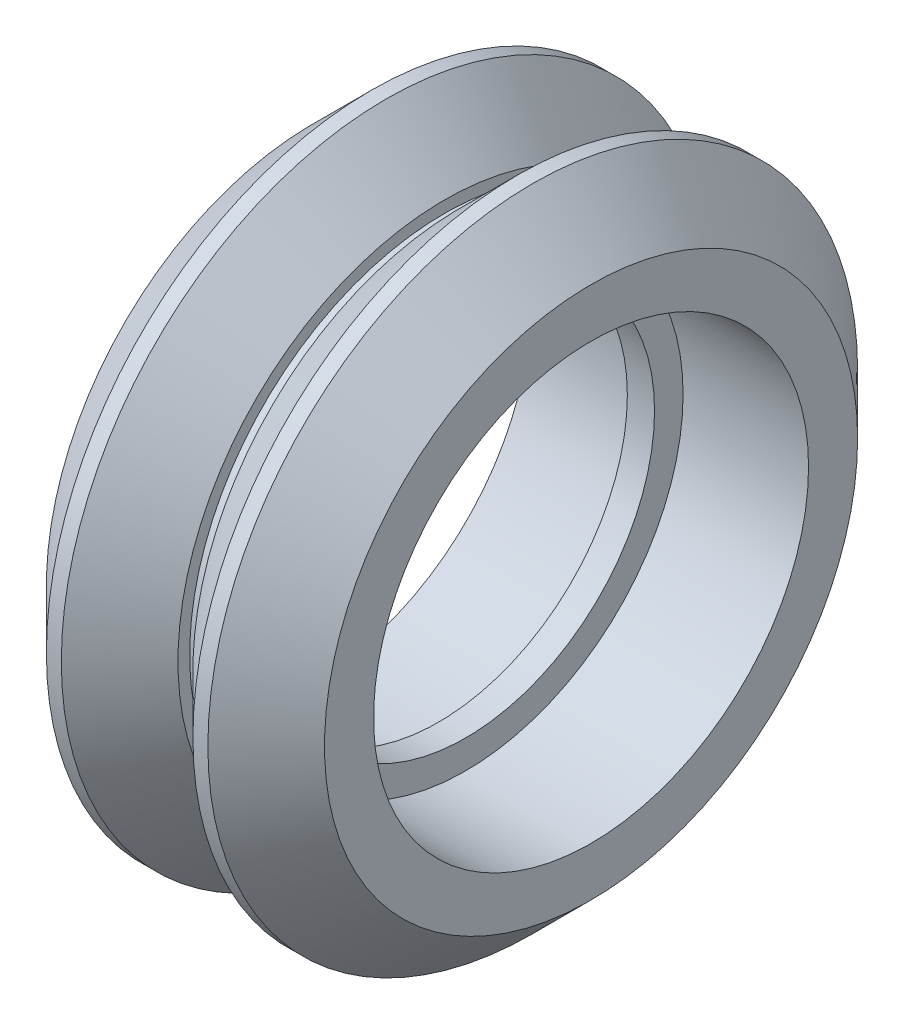
ISO-10303-21;
HEADER;
FILE_DESCRIPTION(('STEP AP214'),'2;1');
FILE_NAME('part.step','',(''),(''),'','','');
FILE_SCHEMA(('AUTOMOTIVE_DESIGN { 1 0 10303 214 1 1 1 1 }'));
ENDSEC;
DATA;
#1=APPLICATION_CONTEXT('core data for automotive mechanical design processes');
#2=APPLICATION_PROTOCOL_DEFINITION('international standard','automotive_design',2000,#1);
#3=PRODUCT_CONTEXT('',#1,'mechanical');
#4=PRODUCT('Part','Part','',(#3));
#5=PRODUCT_RELATED_PRODUCT_CATEGORY('part','',(#4));
#6=PRODUCT_DEFINITION_FORMATION('','',#4);
#7=PRODUCT_DEFINITION_CONTEXT('part definition',#1,'design');
#8=PRODUCT_DEFINITION('design','',#6,#7);
#9=PRODUCT_DEFINITION_SHAPE('','',#8);
#10=(LENGTH_UNIT() NAMED_UNIT(*) SI_UNIT(.MILLI.,.METRE.));
#11=(NAMED_UNIT(*) PLANE_ANGLE_UNIT() SI_UNIT($,.RADIAN.));
#12=(NAMED_UNIT(*) SI_UNIT($,.STERADIAN.) SOLID_ANGLE_UNIT());
#13=UNCERTAINTY_MEASURE_WITH_UNIT(LENGTH_MEASURE(1.E-05),#10,'distance_accuracy_value','');
#14=(GEOMETRIC_REPRESENTATION_CONTEXT(3) GLOBAL_UNCERTAINTY_ASSIGNED_CONTEXT((#13)) GLOBAL_UNIT_ASSIGNED_CONTEXT((#10,
#11,#12)) REPRESENTATION_CONTEXT('',''));
#15=CARTESIAN_POINT('',(0.,0.,0.));
#16=DIRECTION('',(0.,0.,1.));
#17=DIRECTION('',(1.,0.,0.));
#18=AXIS2_PLACEMENT_3D('',#15,#16,#17);
#19=CARTESIAN_POINT('',(-0.499999999999999,6.95,0.));
#20=DIRECTION('',(-1.,0.,0.));
#21=DIRECTION('',(0.,0.,1.));
#22=AXIS2_PLACEMENT_3D('',#19,#20,#21);
#23=PLANE('',#22);
#24=CARTESIAN_POINT('',(-0.499999999999999,0.,0.));
#25=DIRECTION('',(1.,0.,0.));
#26=DIRECTION('',(0.,0.,-1.));
#27=AXIS2_PLACEMENT_3D('',#24,#25,#26);
#28=CIRCLE('',#27,6.95);
#29=CARTESIAN_POINT('',(-0.499999999999999,0.,-6.95));
#30=VERTEX_POINT('',#29);
#31=EDGE_CURVE('E10',#30,#30,#28,.T.);
#32=ORIENTED_EDGE('',*,*,#31,.T.);
#33=EDGE_LOOP('',(#32));
#34=FACE_BOUND('',#33,.T.);
#35=CARTESIAN_POINT('',(-0.499999999999999,0.,0.));
#36=DIRECTION('',(1.,0.,0.));
#37=DIRECTION('',(0.,0.,-1.));
#38=AXIS2_PLACEMENT_3D('',#35,#36,#37);
#39=CIRCLE('',#38,8.);
#40=CARTESIAN_POINT('',(-0.499999999999999,0.,-8.));
#41=VERTEX_POINT('',#40);
#42=EDGE_CURVE('E84',#41,#41,#39,.T.);
#43=ORIENTED_EDGE('',*,*,#42,.F.);
#44=EDGE_LOOP('',(#43));
#45=FACE_BOUND('',#44,.T.);
#46=ADVANCED_FACE('F32',(#34,#45),#23,.T.);
#47=CARTESIAN_POINT('',(0.,0.,0.));
#48=DIRECTION('',(1.,0.,0.));
#49=DIRECTION('',(0.,0.,-1.));
#50=AXIS2_PLACEMENT_3D('',#47,#48,#49);
#51=CYLINDRICAL_SURFACE('',#50,6.95);
#52=CARTESIAN_POINT('',(0.500000000000001,0.,0.));
#53=DIRECTION('',(1.,0.,0.));
#54=DIRECTION('',(0.,0.,-1.));
#55=AXIS2_PLACEMENT_3D('',#52,#53,#54);
#56=CIRCLE('',#55,6.95);
#57=CARTESIAN_POINT('',(0.500000000000001,0.,-6.95));
#58=VERTEX_POINT('',#57);
#59=EDGE_CURVE('E38',#58,#58,#56,.T.);
#60=ORIENTED_EDGE('',*,*,#59,.T.);
#61=EDGE_LOOP('',(#60));
#62=FACE_BOUND('',#61,.T.);
#63=ORIENTED_EDGE('',*,*,#31,.F.);
#64=EDGE_LOOP('',(#63));
#65=FACE_BOUND('',#64,.T.);
#66=ADVANCED_FACE('F92',(#62,#65),#51,.F.);
#67=CARTESIAN_POINT('',(0.500000000000001,6.95,0.));
#68=DIRECTION('',(1.,0.,0.));
#69=DIRECTION('',(0.,0.,-1.));
#70=AXIS2_PLACEMENT_3D('',#67,#68,#69);
#71=PLANE('',#70);
#72=CARTESIAN_POINT('',(0.5,0.,0.));
#73=DIRECTION('',(1.,0.,0.));
#74=DIRECTION('',(0.,0.,-1.));
#75=AXIS2_PLACEMENT_3D('',#72,#73,#74);
#76=CIRCLE('',#75,8.);
#77=CARTESIAN_POINT('',(0.5,0.,-8.));
#78=VERTEX_POINT('',#77);
#79=EDGE_CURVE('E42',#78,#78,#76,.T.);
#80=ORIENTED_EDGE('',*,*,#79,.T.);
#81=EDGE_LOOP('',(#80));
#82=FACE_BOUND('',#81,.T.);
#83=ORIENTED_EDGE('',*,*,#59,.F.);
#84=EDGE_LOOP('',(#83));
#85=FACE_BOUND('',#84,.T.);
#86=ADVANCED_FACE('F96',(#82,#85),#71,.T.);
#87=CARTESIAN_POINT('',(0.,0.,0.));
#88=DIRECTION('',(1.,0.,0.));
#89=DIRECTION('',(0.,0.,-1.));
#90=AXIS2_PLACEMENT_3D('',#87,#88,#89);
#91=CYLINDRICAL_SURFACE('',#90,8.);
#92=CARTESIAN_POINT('',(5.115,0.,0.));
#93=DIRECTION('',(1.,0.,0.));
#94=DIRECTION('',(0.,0.,-1.));
#95=AXIS2_PLACEMENT_3D('',#92,#93,#94);
#96=CIRCLE('',#95,8.);
#97=CARTESIAN_POINT('',(5.115,0.,-8.));
#98=VERTEX_POINT('',#97);
#99=EDGE_CURVE('E46',#98,#98,#96,.T.);
#100=ORIENTED_EDGE('',*,*,#99,.T.);
#101=EDGE_LOOP('',(#100));
#102=FACE_BOUND('',#101,.T.);
#103=ORIENTED_EDGE('',*,*,#79,.F.);
#104=EDGE_LOOP('',(#103));
#105=FACE_BOUND('',#104,.T.);
#106=ADVANCED_FACE('F100',(#102,#105),#91,.F.);
#107=CARTESIAN_POINT('',(5.115,8.,0.));
#108=DIRECTION('',(1.,0.,0.));
#109=DIRECTION('',(0.,0.,-1.));
#110=AXIS2_PLACEMENT_3D('',#107,#108,#109);
#111=PLANE('',#110);
#112=CARTESIAN_POINT('',(5.115,0.,0.));
#113=DIRECTION('',(1.,0.,0.));
#114=DIRECTION('',(0.,0.,-1.));
#115=AXIS2_PLACEMENT_3D('',#112,#113,#114);
#116=CIRCLE('',#115,9.805);
#117=CARTESIAN_POINT('',(5.115,0.,-9.805));
#118=VERTEX_POINT('',#117);
#119=EDGE_CURVE('E51',#118,#118,#116,.T.);
#120=ORIENTED_EDGE('',*,*,#119,.T.);
#121=EDGE_LOOP('',(#120));
#122=FACE_BOUND('',#121,.T.);
#123=ORIENTED_EDGE('',*,*,#99,.F.);
#124=EDGE_LOOP('',(#123));
#125=FACE_BOUND('',#124,.T.);
#126=ADVANCED_FACE('F107',(#122,#125),#111,.T.);
#127=CARTESIAN_POINT('',(5.115,0.,0.));
#128=DIRECTION('',(-1.,0.,0.));
#129=DIRECTION('',(0.,0.,1.));
#130=AXIS2_PLACEMENT_3D('',#127,#128,#129);
#131=CONICAL_SURFACE('',#130,9.805,0.785398163397447);
#132=CARTESIAN_POINT('',(2.96999999999999,0.,0.));
#133=DIRECTION('',(1.,0.,0.));
#134=DIRECTION('',(0.,0.,-1.));
#135=AXIS2_PLACEMENT_3D('',#132,#133,#134);
#136=CIRCLE('',#135,11.95);
#137=CARTESIAN_POINT('',(2.96999999999999,0.,-11.95));
#138=VERTEX_POINT('',#137);
#139=EDGE_CURVE('E54',#138,#138,#136,.T.);
#140=ORIENTED_EDGE('',*,*,#139,.T.);
#141=EDGE_LOOP('',(#140));
#142=FACE_BOUND('',#141,.T.);
#143=ORIENTED_EDGE('',*,*,#119,.F.);
#144=EDGE_LOOP('',(#143));
#145=FACE_BOUND('',#144,.T.);
#146=ADVANCED_FACE('F111',(#142,#145),#131,.T.);
#147=CARTESIAN_POINT('',(0.,0.,0.));
#148=DIRECTION('',(1.,0.,0.));
#149=DIRECTION('',(0.,0.,-1.));
#150=AXIS2_PLACEMENT_3D('',#147,#148,#149);
#151=CYLINDRICAL_SURFACE('',#150,11.95);
#152=CARTESIAN_POINT('',(2.41999999999999,0.,0.));
#153=DIRECTION('',(1.,0.,0.));
#154=DIRECTION('',(0.,0.,-1.));
#155=AXIS2_PLACEMENT_3D('',#152,#153,#154);
#156=CIRCLE('',#155,11.95);
#157=CARTESIAN_POINT('',(2.41999999999999,0.,-11.95));
#158=VERTEX_POINT('',#157);
#159=EDGE_CURVE('E57',#158,#158,#156,.T.);
#160=ORIENTED_EDGE('',*,*,#159,.T.);
#161=EDGE_LOOP('',(#160));
#162=FACE_BOUND('',#161,.T.);
#163=ORIENTED_EDGE('',*,*,#139,.F.);
#164=EDGE_LOOP('',(#163));
#165=FACE_BOUND('',#164,.T.);
#166=ADVANCED_FACE('F115',(#162,#165),#151,.T.);
#167=CARTESIAN_POINT('',(2.41999999999999,0.,0.));
#168=DIRECTION('',(1.,0.,0.));
#169=DIRECTION('',(0.,0.,-1.));
#170=AXIS2_PLACEMENT_3D('',#167,#168,#169);
#171=CONICAL_SURFACE('',#170,11.95,0.78539816339745);
#172=CARTESIAN_POINT('',(0.275000000000002,0.,0.));
#173=DIRECTION('',(1.,0.,0.));
#174=DIRECTION('',(0.,0.,-1.));
#175=AXIS2_PLACEMENT_3D('',#172,#173,#174);
#176=CIRCLE('',#175,9.805);
#177=CARTESIAN_POINT('',(0.275000000000002,0.,-9.805));
#178=VERTEX_POINT('',#177);
#179=EDGE_CURVE('E60',#178,#178,#176,.T.);
#180=ORIENTED_EDGE('',*,*,#179,.T.);
#181=EDGE_LOOP('',(#180));
#182=FACE_BOUND('',#181,.T.);
#183=ORIENTED_EDGE('',*,*,#159,.F.);
#184=EDGE_LOOP('',(#183));
#185=FACE_BOUND('',#184,.T.);
#186=ADVANCED_FACE('F119',(#182,#185),#171,.T.);
#187=CARTESIAN_POINT('',(0.275,9.805,0.));
#188=DIRECTION('',(-1.,0.,0.));
#189=DIRECTION('',(0.,0.,1.));
#190=AXIS2_PLACEMENT_3D('',#187,#188,#189);
#191=PLANE('',#190);
#192=CARTESIAN_POINT('',(0.274999999999999,0.,0.));
#193=DIRECTION('',(1.,0.,0.));
#194=DIRECTION('',(0.,0.,-1.));
#195=AXIS2_PLACEMENT_3D('',#192,#193,#194);
#196=CIRCLE('',#195,9.375);
#197=CARTESIAN_POINT('',(0.274999999999999,0.,-9.375));
#198=VERTEX_POINT('',#197);
#199=EDGE_CURVE('E63',#198,#198,#196,.T.);
#200=ORIENTED_EDGE('',*,*,#199,.T.);
#201=EDGE_LOOP('',(#200));
#202=FACE_BOUND('',#201,.T.);
#203=ORIENTED_EDGE('',*,*,#179,.F.);
#204=EDGE_LOOP('',(#203));
#205=FACE_BOUND('',#204,.T.);
#206=ADVANCED_FACE('F123',(#202,#205),#191,.T.);
#207=CARTESIAN_POINT('',(0.,0.,0.));
#208=DIRECTION('',(1.,0.,0.));
#209=DIRECTION('',(0.,0.,-1.));
#210=AXIS2_PLACEMENT_3D('',#207,#208,#209);
#211=CYLINDRICAL_SURFACE('',#210,9.375);
#212=CARTESIAN_POINT('',(-0.275000000000001,0.,0.));
#213=DIRECTION('',(1.,0.,0.));
#214=DIRECTION('',(0.,0.,-1.));
#215=AXIS2_PLACEMENT_3D('',#212,#213,#214);
#216=CIRCLE('',#215,9.375);
#217=CARTESIAN_POINT('',(-0.275000000000001,0.,-9.375));
#218=VERTEX_POINT('',#217);
#219=EDGE_CURVE('E66',#218,#218,#216,.T.);
#220=ORIENTED_EDGE('',*,*,#219,.T.);
#221=EDGE_LOOP('',(#220));
#222=FACE_BOUND('',#221,.T.);
#223=ORIENTED_EDGE('',*,*,#199,.F.);
#224=EDGE_LOOP('',(#223));
#225=FACE_BOUND('',#224,.T.);
#226=ADVANCED_FACE('F127',(#222,#225),#211,.T.);
#227=CARTESIAN_POINT('',(-0.275000000000001,9.805,0.));
#228=DIRECTION('',(1.,0.,0.));
#229=DIRECTION('',(0.,0.,-1.));
#230=AXIS2_PLACEMENT_3D('',#227,#228,#229);
#231=PLANE('',#230);
#232=CARTESIAN_POINT('',(-0.275000000000001,0.,0.));
#233=DIRECTION('',(1.,0.,0.));
#234=DIRECTION('',(0.,0.,-1.));
#235=AXIS2_PLACEMENT_3D('',#232,#233,#234);
#236=CIRCLE('',#235,9.805);
#237=CARTESIAN_POINT('',(-0.275000000000001,0.,-9.805));
#238=VERTEX_POINT('',#237);
#239=EDGE_CURVE('E69',#238,#238,#236,.T.);
#240=ORIENTED_EDGE('',*,*,#239,.T.);
#241=EDGE_LOOP('',(#240));
#242=FACE_BOUND('',#241,.T.);
#243=ORIENTED_EDGE('',*,*,#219,.F.);
#244=EDGE_LOOP('',(#243));
#245=FACE_BOUND('',#244,.T.);
#246=ADVANCED_FACE('F131',(#242,#245),#231,.T.);
#247=CARTESIAN_POINT('',(-0.275000000000001,0.,0.));
#248=DIRECTION('',(-1.,0.,0.));
#249=DIRECTION('',(0.,0.,1.));
#250=AXIS2_PLACEMENT_3D('',#247,#248,#249);
#251=CONICAL_SURFACE('',#250,9.805,0.78539816339745);
#252=CARTESIAN_POINT('',(-2.41999999999999,0.,0.));
#253=DIRECTION('',(1.,0.,0.));
#254=DIRECTION('',(0.,0.,-1.));
#255=AXIS2_PLACEMENT_3D('',#252,#253,#254);
#256=CIRCLE('',#255,11.95);
#257=CARTESIAN_POINT('',(-2.41999999999999,0.,-11.95));
#258=VERTEX_POINT('',#257);
#259=EDGE_CURVE('E72',#258,#258,#256,.T.);
#260=ORIENTED_EDGE('',*,*,#259,.T.);
#261=EDGE_LOOP('',(#260));
#262=FACE_BOUND('',#261,.T.);
#263=ORIENTED_EDGE('',*,*,#239,.F.);
#264=EDGE_LOOP('',(#263));
#265=FACE_BOUND('',#264,.T.);
#266=ADVANCED_FACE('F135',(#262,#265),#251,.T.);
#267=CARTESIAN_POINT('',(0.,0.,0.));
#268=DIRECTION('',(1.,0.,0.));
#269=DIRECTION('',(0.,0.,-1.));
#270=AXIS2_PLACEMENT_3D('',#267,#268,#269);
#271=CYLINDRICAL_SURFACE('',#270,11.95);
#272=CARTESIAN_POINT('',(-2.96999999999999,0.,0.));
#273=DIRECTION('',(1.,0.,0.));
#274=DIRECTION('',(0.,0.,-1.));
#275=AXIS2_PLACEMENT_3D('',#272,#273,#274);
#276=CIRCLE('',#275,11.95);
#277=CARTESIAN_POINT('',(-2.96999999999999,0.,-11.95));
#278=VERTEX_POINT('',#277);
#279=EDGE_CURVE('E75',#278,#278,#276,.T.);
#280=ORIENTED_EDGE('',*,*,#279,.T.);
#281=EDGE_LOOP('',(#280));
#282=FACE_BOUND('',#281,.T.);
#283=ORIENTED_EDGE('',*,*,#259,.F.);
#284=EDGE_LOOP('',(#283));
#285=FACE_BOUND('',#284,.T.);
#286=ADVANCED_FACE('F139',(#282,#285),#271,.T.);
#287=CARTESIAN_POINT('',(-2.96999999999999,0.,0.));
#288=DIRECTION('',(1.,0.,0.));
#289=DIRECTION('',(0.,0.,-1.));
#290=AXIS2_PLACEMENT_3D('',#287,#288,#289);
#291=CONICAL_SURFACE('',#290,11.95,0.785398163397447);
#292=CARTESIAN_POINT('',(-5.115,0.,0.));
#293=DIRECTION('',(1.,0.,0.));
#294=DIRECTION('',(0.,0.,-1.));
#295=AXIS2_PLACEMENT_3D('',#292,#293,#294);
#296=CIRCLE('',#295,9.805);
#297=CARTESIAN_POINT('',(-5.115,0.,-9.805));
#298=VERTEX_POINT('',#297);
#299=EDGE_CURVE('E78',#298,#298,#296,.T.);
#300=ORIENTED_EDGE('',*,*,#299,.T.);
#301=EDGE_LOOP('',(#300));
#302=FACE_BOUND('',#301,.T.);
#303=ORIENTED_EDGE('',*,*,#279,.F.);
#304=EDGE_LOOP('',(#303));
#305=FACE_BOUND('',#304,.T.);
#306=ADVANCED_FACE('F143',(#302,#305),#291,.T.);
#307=CARTESIAN_POINT('',(-5.115,8.,0.));
#308=DIRECTION('',(-1.,0.,0.));
#309=DIRECTION('',(0.,0.,1.));
#310=AXIS2_PLACEMENT_3D('',#307,#308,#309);
#311=PLANE('',#310);
#312=CARTESIAN_POINT('',(-5.115,0.,0.));
#313=DIRECTION('',(1.,0.,0.));
#314=DIRECTION('',(0.,0.,-1.));
#315=AXIS2_PLACEMENT_3D('',#312,#313,#314);
#316=CIRCLE('',#315,8.);
#317=CARTESIAN_POINT('',(-5.115,0.,-8.));
#318=VERTEX_POINT('',#317);
#319=EDGE_CURVE('E81',#318,#318,#316,.T.);
#320=ORIENTED_EDGE('',*,*,#319,.T.);
#321=EDGE_LOOP('',(#320));
#322=FACE_BOUND('',#321,.T.);
#323=ORIENTED_EDGE('',*,*,#299,.F.);
#324=EDGE_LOOP('',(#323));
#325=FACE_BOUND('',#324,.T.);
#326=ADVANCED_FACE('F147',(#322,#325),#311,.T.);
#327=CARTESIAN_POINT('',(0.,0.,0.));
#328=DIRECTION('',(1.,0.,0.));
#329=DIRECTION('',(0.,0.,-1.));
#330=AXIS2_PLACEMENT_3D('',#327,#328,#329);
#331=CYLINDRICAL_SURFACE('',#330,8.);
#332=ORIENTED_EDGE('',*,*,#42,.T.);
#333=EDGE_LOOP('',(#332));
#334=FACE_BOUND('',#333,.T.);
#335=ORIENTED_EDGE('',*,*,#319,.F.);
#336=EDGE_LOOP('',(#335));
#337=FACE_BOUND('',#336,.T.);
#338=ADVANCED_FACE('F88',(#334,#337),#331,.F.);
#339=CLOSED_SHELL('',(#46,#66,#86,#106,#126,#146,#166,#186,#206,#226,#246,#266,#286,#306,#326,#338));
#340=MANIFOLD_SOLID_BREP('B2',#339);
#341=ADVANCED_BREP_SHAPE_REPRESENTATION('',(#18,#340),#14);
#342=SHAPE_DEFINITION_REPRESENTATION(#9,#341);
ENDSEC;
END-ISO-10303-21;
